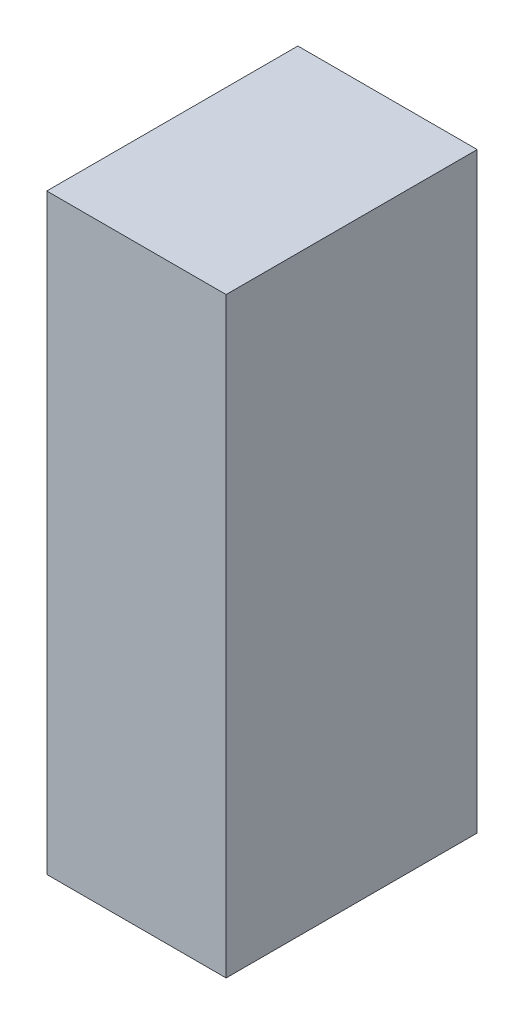
ISO-10303-21;
HEADER;
FILE_DESCRIPTION(('STEP AP214'),'2;1');
FILE_NAME('part.step','',(''),(''),'','','');
FILE_SCHEMA(('AUTOMOTIVE_DESIGN { 1 0 10303 214 1 1 1 1 }'));
ENDSEC;
DATA;
#1=APPLICATION_CONTEXT('core data for automotive mechanical design processes');
#2=APPLICATION_PROTOCOL_DEFINITION('international standard','automotive_design',2000,#1);
#3=PRODUCT_CONTEXT('',#1,'mechanical');
#4=PRODUCT('Part','Part','',(#3));
#5=PRODUCT_RELATED_PRODUCT_CATEGORY('part','',(#4));
#6=PRODUCT_DEFINITION_FORMATION('','',#4);
#7=PRODUCT_DEFINITION_CONTEXT('part definition',#1,'design');
#8=PRODUCT_DEFINITION('design','',#6,#7);
#9=PRODUCT_DEFINITION_SHAPE('','',#8);
#10=(LENGTH_UNIT() NAMED_UNIT(*) SI_UNIT(.MILLI.,.METRE.));
#11=(NAMED_UNIT(*) PLANE_ANGLE_UNIT() SI_UNIT($,.RADIAN.));
#12=(NAMED_UNIT(*) SI_UNIT($,.STERADIAN.) SOLID_ANGLE_UNIT());
#13=UNCERTAINTY_MEASURE_WITH_UNIT(LENGTH_MEASURE(1.E-05),#10,'distance_accuracy_value','');
#14=(GEOMETRIC_REPRESENTATION_CONTEXT(3) GLOBAL_UNCERTAINTY_ASSIGNED_CONTEXT((#13)) GLOBAL_UNIT_ASSIGNED_CONTEXT((#10,
#11,#12)) REPRESENTATION_CONTEXT('',''));
#15=CARTESIAN_POINT('',(0.,0.,0.));
#16=DIRECTION('',(0.,0.,1.));
#17=DIRECTION('',(1.,0.,0.));
#18=AXIS2_PLACEMENT_3D('',#15,#16,#17);
#19=CARTESIAN_POINT('',(-1.62498496456705,-0.825002072309957,-2.84112203121185));
#20=DIRECTION('',(-4.37113882867379E-08,-1.,0.));
#21=DIRECTION('',(1.,-4.37113882867379E-08,0.));
#22=AXIS2_PLACEMENT_3D('',#19,#20,#21);
#23=PLANE('',#22);
#24=DIRECTION('',(0.999999999999999,-4.37113882475976E-08,0.));
#25=VECTOR('',#24,1.);
#26=CARTESIAN_POINT('',(-1.62498496456705,-0.825002072309957,-2.84112203121185));
#27=LINE('',#26,#25);
#28=CARTESIAN_POINT('',(-1.62498496456705,-0.825002072309957,-2.84112203121185));
#29=VERTEX_POINT('',#28);
#30=CARTESIAN_POINT('',(-1.12499259396158,-0.825002094165313,-2.84112203121185));
#31=VERTEX_POINT('',#30);
#32=EDGE_CURVE('E11',#29,#31,#27,.T.);
#33=ORIENTED_EDGE('',*,*,#32,.T.);
#34=DIRECTION('',(0.,0.,1.));
#35=VECTOR('',#34,1.);
#36=CARTESIAN_POINT('',(-1.12499259396158,-0.825002094165317,-2.84112203121185));
#37=LINE('',#36,#35);
#38=CARTESIAN_POINT('',(-1.12499259396158,-0.825002094165313,-2.14112091064453));
#39=VERTEX_POINT('',#38);
#40=EDGE_CURVE('E88',#31,#39,#37,.T.);
#41=ORIENTED_EDGE('',*,*,#40,.T.);
#42=DIRECTION('',(0.999999999999999,-4.37113882475976E-08,0.));
#43=VECTOR('',#42,1.);
#44=CARTESIAN_POINT('',(-1.62498496456705,-0.825002072309957,-2.14112091064453));
#45=LINE('',#44,#43);
#46=CARTESIAN_POINT('',(-1.62498496456705,-0.825002072309957,-2.14112091064453));
#47=VERTEX_POINT('',#46);
#48=EDGE_CURVE('E83',#47,#39,#45,.T.);
#49=ORIENTED_EDGE('',*,*,#48,.F.);
#50=DIRECTION('',(0.,0.,1.));
#51=VECTOR('',#50,1.);
#52=CARTESIAN_POINT('',(-1.62498496456704,-0.825002072309956,-2.84112203121185));
#53=LINE('',#52,#51);
#54=EDGE_CURVE('E72',#29,#47,#53,.T.);
#55=ORIENTED_EDGE('',*,*,#54,.F.);
#56=EDGE_LOOP('',(#33,#41,#49,#55));
#57=FACE_BOUND('',#56,.T.);
#58=ADVANCED_FACE('F17',(#57),#23,.T.);
#59=CARTESIAN_POINT('',(-1.12499259396158,-0.825002094165313,-2.84112203121185));
#60=DIRECTION('',(1.,-4.37113882867379E-08,0.));
#61=DIRECTION('',(4.37113882867379E-08,1.,0.));
#62=AXIS2_PLACEMENT_3D('',#59,#60,#61);
#63=PLANE('',#62);
#64=DIRECTION('',(4.37113882740561E-08,0.999999999999999,0.));
#65=VECTOR('',#64,1.);
#66=CARTESIAN_POINT('',(-1.12499259396158,-0.825002094165313,-2.84112203121185));
#67=LINE('',#66,#65);
#68=CARTESIAN_POINT('',(-1.12499252183738,0.825007061108124,-2.84112203121185));
#69=VERTEX_POINT('',#68);
#70=EDGE_CURVE('E24',#31,#69,#67,.T.);
#71=ORIENTED_EDGE('',*,*,#70,.T.);
#72=DIRECTION('',(0.,0.,1.));
#73=VECTOR('',#72,1.);
#74=CARTESIAN_POINT('',(-1.12499252183739,0.825007061108124,-2.84112203121185));
#75=LINE('',#74,#73);
#76=CARTESIAN_POINT('',(-1.12499252183738,0.825007061108124,-2.14112091064453));
#77=VERTEX_POINT('',#76);
#78=EDGE_CURVE('E85',#69,#77,#75,.T.);
#79=ORIENTED_EDGE('',*,*,#78,.T.);
#80=DIRECTION('',(4.37113882740561E-08,0.999999999999999,0.));
#81=VECTOR('',#80,1.);
#82=CARTESIAN_POINT('',(-1.12499259396158,-0.825002094165313,-2.14112091064453));
#83=LINE('',#82,#81);
#84=EDGE_CURVE('E66',#39,#77,#83,.T.);
#85=ORIENTED_EDGE('',*,*,#84,.F.);
#86=ORIENTED_EDGE('',*,*,#40,.F.);
#87=EDGE_LOOP('',(#71,#79,#85,#86));
#88=FACE_BOUND('',#87,.T.);
#89=ADVANCED_FACE('F89',(#88),#63,.T.);
#90=CARTESIAN_POINT('',(-1.12499252183738,0.825007061108124,-2.84112203121185));
#91=DIRECTION('',(4.37113882867379E-08,1.,0.));
#92=DIRECTION('',(-1.,4.37113882867379E-08,0.));
#93=AXIS2_PLACEMENT_3D('',#90,#91,#92);
#94=PLANE('',#93);
#95=DIRECTION('',(-0.999999999999999,4.37113882475976E-08,0.));
#96=VECTOR('',#95,1.);
#97=CARTESIAN_POINT('',(-1.12499252183738,0.825007061108124,-2.84112203121185));
#98=LINE('',#97,#96);
#99=CARTESIAN_POINT('',(-1.62498489244285,0.825007082963481,-2.84112203121185));
#100=VERTEX_POINT('',#99);
#101=EDGE_CURVE('E62',#69,#100,#98,.T.);
#102=ORIENTED_EDGE('',*,*,#101,.T.);
#103=DIRECTION('',(0.,0.,1.));
#104=VECTOR('',#103,1.);
#105=CARTESIAN_POINT('',(-1.62498489244285,0.825007082963485,-2.84112203121185));
#106=LINE('',#105,#104);
#107=CARTESIAN_POINT('',(-1.62498489244285,0.825007082963481,-2.14112091064453));
#108=VERTEX_POINT('',#107);
#109=EDGE_CURVE('E55',#100,#108,#106,.T.);
#110=ORIENTED_EDGE('',*,*,#109,.T.);
#111=DIRECTION('',(-0.999999999999999,4.37113882475976E-08,0.));
#112=VECTOR('',#111,1.);
#113=CARTESIAN_POINT('',(-1.12499252183738,0.825007061108124,-2.14112091064453));
#114=LINE('',#113,#112);
#115=EDGE_CURVE('E59',#77,#108,#114,.T.);
#116=ORIENTED_EDGE('',*,*,#115,.F.);
#117=ORIENTED_EDGE('',*,*,#78,.F.);
#118=EDGE_LOOP('',(#102,#110,#116,#117));
#119=FACE_BOUND('',#118,.T.);
#120=ADVANCED_FACE('F57',(#119),#94,.T.);
#121=CARTESIAN_POINT('',(-1.62498489244285,0.825007082963481,-2.84112203121185));
#122=DIRECTION('',(-1.,4.37113882867379E-08,0.));
#123=DIRECTION('',(-4.37113882867379E-08,-1.,0.));
#124=AXIS2_PLACEMENT_3D('',#121,#122,#123);
#125=PLANE('',#124);
#126=DIRECTION('',(-4.37113882740561E-08,-0.999999999999999,0.));
#127=VECTOR('',#126,1.);
#128=CARTESIAN_POINT('',(-1.62498489244285,0.825007082963481,-2.84112203121185));
#129=LINE('',#128,#127);
#130=EDGE_CURVE('E65',#100,#29,#129,.T.);
#131=ORIENTED_EDGE('',*,*,#130,.T.);
#132=ORIENTED_EDGE('',*,*,#54,.T.);
#133=DIRECTION('',(-4.37113882740561E-08,-0.999999999999999,0.));
#134=VECTOR('',#133,1.);
#135=CARTESIAN_POINT('',(-1.62498489244285,0.825007082963481,-2.14112091064453));
#136=LINE('',#135,#134);
#137=EDGE_CURVE('E70',#108,#47,#136,.T.);
#138=ORIENTED_EDGE('',*,*,#137,.F.);
#139=ORIENTED_EDGE('',*,*,#109,.F.);
#140=EDGE_LOOP('',(#131,#132,#138,#139));
#141=FACE_BOUND('',#140,.T.);
#142=ADVANCED_FACE('F71',(#141),#125,.T.);
#143=CARTESIAN_POINT('',(-118.849983215332,178.824996948242,-2.14112091064453));
#144=DIRECTION('',(0.,0.,1.));
#145=DIRECTION('',(-4.37113882867379E-08,-1.,0.));
#146=AXIS2_PLACEMENT_3D('',#143,#144,#145);
#147=PLANE('',#146);
#148=ORIENTED_EDGE('',*,*,#48,.T.);
#149=ORIENTED_EDGE('',*,*,#84,.T.);
#150=ORIENTED_EDGE('',*,*,#115,.T.);
#151=ORIENTED_EDGE('',*,*,#137,.T.);
#152=EDGE_LOOP('',(#148,#149,#150,#151));
#153=FACE_BOUND('',#152,.T.);
#154=ADVANCED_FACE('F76',(#153),#147,.T.);
#155=CARTESIAN_POINT('',(-118.849983215332,178.824996948242,-2.84112203121185));
#156=DIRECTION('',(0.,0.,1.));
#157=DIRECTION('',(-4.37113882867379E-08,-1.,0.));
#158=AXIS2_PLACEMENT_3D('',#155,#156,#157);
#159=PLANE('',#158);
#160=ORIENTED_EDGE('',*,*,#130,.F.);
#161=ORIENTED_EDGE('',*,*,#101,.F.);
#162=ORIENTED_EDGE('',*,*,#70,.F.);
#163=ORIENTED_EDGE('',*,*,#32,.F.);
#164=EDGE_LOOP('',(#160,#161,#162,#163));
#165=FACE_BOUND('',#164,.T.);
#166=ADVANCED_FACE('F91',(#165),#159,.F.);
#167=CLOSED_SHELL('',(#58,#89,#120,#142,#154,#166));
#168=MANIFOLD_SOLID_BREP('B1',#167);
#169=ADVANCED_BREP_SHAPE_REPRESENTATION('',(#18,#168),#14);
#170=SHAPE_DEFINITION_REPRESENTATION(#9,#169);
ENDSEC;
END-ISO-10303-21;
